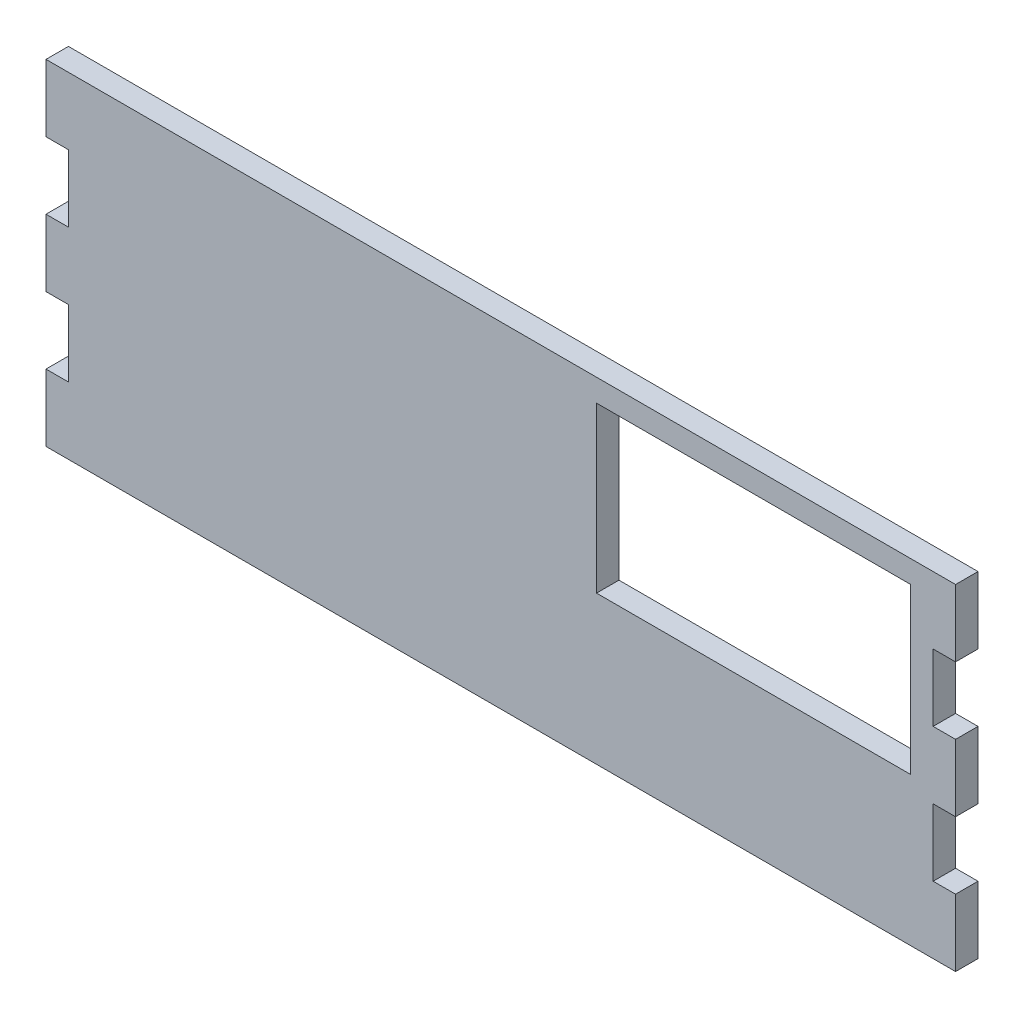
ISO-10303-21;
HEADER;
FILE_DESCRIPTION(('STEP AP214'),'2;1');
FILE_NAME('part.step','',(''),(''),'','','');
FILE_SCHEMA(('AUTOMOTIVE_DESIGN { 1 0 10303 214 1 1 1 1 }'));
ENDSEC;
DATA;
#1=APPLICATION_CONTEXT('core data for automotive mechanical design processes');
#2=APPLICATION_PROTOCOL_DEFINITION('international standard','automotive_design',2000,#1);
#3=PRODUCT_CONTEXT('',#1,'mechanical');
#4=PRODUCT('Part','Part','',(#3));
#5=PRODUCT_RELATED_PRODUCT_CATEGORY('part','',(#4));
#6=PRODUCT_DEFINITION_FORMATION('','',#4);
#7=PRODUCT_DEFINITION_CONTEXT('part definition',#1,'design');
#8=PRODUCT_DEFINITION('design','',#6,#7);
#9=PRODUCT_DEFINITION_SHAPE('','',#8);
#10=(LENGTH_UNIT() NAMED_UNIT(*) SI_UNIT(.MILLI.,.METRE.));
#11=(NAMED_UNIT(*) PLANE_ANGLE_UNIT() SI_UNIT($,.RADIAN.));
#12=(NAMED_UNIT(*) SI_UNIT($,.STERADIAN.) SOLID_ANGLE_UNIT());
#13=UNCERTAINTY_MEASURE_WITH_UNIT(LENGTH_MEASURE(1.E-05),#10,'distance_accuracy_value','');
#14=(GEOMETRIC_REPRESENTATION_CONTEXT(3) GLOBAL_UNCERTAINTY_ASSIGNED_CONTEXT((#13)) GLOBAL_UNIT_ASSIGNED_CONTEXT((#10,
#11,#12)) REPRESENTATION_CONTEXT('',''));
#15=CARTESIAN_POINT('',(0.,0.,0.));
#16=DIRECTION('',(0.,0.,1.));
#17=DIRECTION('',(1.,0.,0.));
#18=AXIS2_PLACEMENT_3D('',#15,#16,#17);
#19=CARTESIAN_POINT('',(0.,0.,3.));
#20=DIRECTION('',(1.,0.,0.));
#21=DIRECTION('',(0.,0.,-1.));
#22=AXIS2_PLACEMENT_3D('',#19,#20,#21);
#23=PLANE('',#22);
#24=DIRECTION('',(0.,-1.,0.));
#25=VECTOR('',#24,1.);
#26=CARTESIAN_POINT('',(0.,0.,3.));
#27=LINE('',#26,#25);
#28=CARTESIAN_POINT('',(0.,26.892,3.));
#29=VERTEX_POINT('',#28);
#30=CARTESIAN_POINT('',(0.,17.928,3.));
#31=VERTEX_POINT('',#30);
#32=EDGE_CURVE('E346',#29,#31,#27,.T.);
#33=ORIENTED_EDGE('',*,*,#32,.F.);
#34=DIRECTION('',(0.,0.,1.));
#35=VECTOR('',#34,1.);
#36=CARTESIAN_POINT('',(0.,26.892,0.));
#37=LINE('',#36,#35);
#38=CARTESIAN_POINT('',(0.,26.892,0.));
#39=VERTEX_POINT('',#38);
#40=EDGE_CURVE('E243',#39,#29,#37,.T.);
#41=ORIENTED_EDGE('',*,*,#40,.F.);
#42=DIRECTION('',(0.,-1.,0.));
#43=VECTOR('',#42,1.);
#44=CARTESIAN_POINT('',(0.,0.,0.));
#45=LINE('',#44,#43);
#46=CARTESIAN_POINT('',(0.,17.928,0.));
#47=VERTEX_POINT('',#46);
#48=EDGE_CURVE('E361',#39,#47,#45,.T.);
#49=ORIENTED_EDGE('',*,*,#48,.T.);
#50=DIRECTION('',(0.,0.,1.));
#51=VECTOR('',#50,1.);
#52=CARTESIAN_POINT('',(0.,17.928,0.));
#53=LINE('',#52,#51);
#54=EDGE_CURVE('E306',#47,#31,#53,.T.);
#55=ORIENTED_EDGE('',*,*,#54,.T.);
#56=EDGE_LOOP('',(#33,#41,#49,#55));
#57=FACE_BOUND('',#56,.T.);
#58=ADVANCED_FACE('F39',(#57),#23,.F.);
#59=CARTESIAN_POINT('',(0.,8.96399999999996,3.));
#60=VERTEX_POINT('',#59);
#61=CARTESIAN_POINT('',(0.,0.,3.));
#62=VERTEX_POINT('',#61);
#63=EDGE_CURVE('E347',#60,#62,#27,.T.);
#64=ORIENTED_EDGE('',*,*,#63,.F.);
#65=DIRECTION('',(0.,0.,1.));
#66=VECTOR('',#65,1.);
#67=CARTESIAN_POINT('',(0.,8.96399999999996,0.));
#68=LINE('',#67,#66);
#69=CARTESIAN_POINT('',(0.,8.96399999999996,0.));
#70=VERTEX_POINT('',#69);
#71=EDGE_CURVE('E304',#70,#60,#68,.T.);
#72=ORIENTED_EDGE('',*,*,#71,.F.);
#73=CARTESIAN_POINT('',(0.,0.,0.));
#74=VERTEX_POINT('',#73);
#75=EDGE_CURVE('E341',#70,#74,#45,.T.);
#76=ORIENTED_EDGE('',*,*,#75,.T.);
#77=DIRECTION('',(0.,0.,-1.));
#78=VECTOR('',#77,1.);
#79=CARTESIAN_POINT('',(0.,0.,3.));
#80=LINE('',#79,#78);
#81=EDGE_CURVE('E11',#62,#74,#80,.T.);
#82=ORIENTED_EDGE('',*,*,#81,.F.);
#83=EDGE_LOOP('',(#64,#72,#76,#82));
#84=FACE_BOUND('',#83,.T.);
#85=ADVANCED_FACE('F399',(#84),#23,.F.);
#86=CARTESIAN_POINT('',(121.6,0.,3.));
#87=DIRECTION('',(-1.,0.,0.));
#88=DIRECTION('',(0.,-1.,0.));
#89=AXIS2_PLACEMENT_3D('',#86,#87,#88);
#90=PLANE('',#89);
#91=DIRECTION('',(0.,1.,0.));
#92=VECTOR('',#91,1.);
#93=CARTESIAN_POINT('',(121.6,0.,3.));
#94=LINE('',#93,#92);
#95=CARTESIAN_POINT('',(121.6,17.9280000000001,3.));
#96=VERTEX_POINT('',#95);
#97=CARTESIAN_POINT('',(121.6,26.8919999999999,3.));
#98=VERTEX_POINT('',#97);
#99=EDGE_CURVE('E354',#96,#98,#94,.T.);
#100=ORIENTED_EDGE('',*,*,#99,.F.);
#101=DIRECTION('',(0.,0.,1.));
#102=VECTOR('',#101,1.);
#103=CARTESIAN_POINT('',(121.6,17.9280000000001,0.));
#104=LINE('',#103,#102);
#105=CARTESIAN_POINT('',(121.6,17.9280000000001,0.));
#106=VERTEX_POINT('',#105);
#107=EDGE_CURVE('E227',#106,#96,#104,.T.);
#108=ORIENTED_EDGE('',*,*,#107,.F.);
#109=DIRECTION('',(0.,1.,0.));
#110=VECTOR('',#109,1.);
#111=CARTESIAN_POINT('',(121.6,0.,0.));
#112=LINE('',#111,#110);
#113=CARTESIAN_POINT('',(121.6,26.8919999999999,0.));
#114=VERTEX_POINT('',#113);
#115=EDGE_CURVE('E368',#106,#114,#112,.T.);
#116=ORIENTED_EDGE('',*,*,#115,.T.);
#117=DIRECTION('',(0.,0.,1.));
#118=VECTOR('',#117,1.);
#119=CARTESIAN_POINT('',(121.6,26.8919999999999,0.));
#120=LINE('',#119,#118);
#121=EDGE_CURVE('E54',#114,#98,#120,.T.);
#122=ORIENTED_EDGE('',*,*,#121,.T.);
#123=EDGE_LOOP('',(#100,#108,#116,#122));
#124=FACE_BOUND('',#123,.T.);
#125=ADVANCED_FACE('F438',(#124),#90,.F.);
#126=CARTESIAN_POINT('',(121.6,35.856,3.));
#127=VERTEX_POINT('',#126);
#128=CARTESIAN_POINT('',(121.6,44.82,3.));
#129=VERTEX_POINT('',#128);
#130=EDGE_CURVE('E349',#127,#129,#94,.T.);
#131=ORIENTED_EDGE('',*,*,#130,.F.);
#132=DIRECTION('',(0.,0.,1.));
#133=VECTOR('',#132,1.);
#134=CARTESIAN_POINT('',(121.6,35.856,0.));
#135=LINE('',#134,#133);
#136=CARTESIAN_POINT('',(121.6,35.856,0.));
#137=VERTEX_POINT('',#136);
#138=EDGE_CURVE('E212',#137,#127,#135,.T.);
#139=ORIENTED_EDGE('',*,*,#138,.F.);
#140=CARTESIAN_POINT('',(121.6,44.82,0.));
#141=VERTEX_POINT('',#140);
#142=EDGE_CURVE('E363',#137,#141,#112,.T.);
#143=ORIENTED_EDGE('',*,*,#142,.T.);
#144=DIRECTION('',(0.,0.,-1.));
#145=VECTOR('',#144,1.);
#146=CARTESIAN_POINT('',(121.6,44.82,3.));
#147=LINE('',#146,#145);
#148=EDGE_CURVE('E372',#129,#141,#147,.T.);
#149=ORIENTED_EDGE('',*,*,#148,.F.);
#150=EDGE_LOOP('',(#131,#139,#143,#149));
#151=FACE_BOUND('',#150,.T.);
#152=ADVANCED_FACE('F458',(#151),#90,.F.);
#153=CARTESIAN_POINT('',(0.,44.82,0.));
#154=VERTEX_POINT('',#153);
#155=CARTESIAN_POINT('',(0.,35.856,0.));
#156=VERTEX_POINT('',#155);
#157=EDGE_CURVE('E357',#154,#156,#45,.T.);
#158=ORIENTED_EDGE('',*,*,#157,.T.);
#159=DIRECTION('',(0.,0.,1.));
#160=VECTOR('',#159,1.);
#161=CARTESIAN_POINT('',(0.,35.856,0.));
#162=LINE('',#161,#160);
#163=CARTESIAN_POINT('',(0.,35.856,3.));
#164=VERTEX_POINT('',#163);
#165=EDGE_CURVE('E240',#156,#164,#162,.T.);
#166=ORIENTED_EDGE('',*,*,#165,.T.);
#167=CARTESIAN_POINT('',(0.,44.82,3.));
#168=VERTEX_POINT('',#167);
#169=EDGE_CURVE('E342',#168,#164,#27,.T.);
#170=ORIENTED_EDGE('',*,*,#169,.F.);
#171=DIRECTION('',(0.,0.,-1.));
#172=VECTOR('',#171,1.);
#173=CARTESIAN_POINT('',(0.,44.82,3.));
#174=LINE('',#173,#172);
#175=EDGE_CURVE('E356',#168,#154,#174,.T.);
#176=ORIENTED_EDGE('',*,*,#175,.T.);
#177=EDGE_LOOP('',(#158,#166,#170,#176));
#178=FACE_BOUND('',#177,.T.);
#179=ADVANCED_FACE('F41',(#178),#23,.F.);
#180=CARTESIAN_POINT('',(0.,0.,3.));
#181=DIRECTION('',(0.,1.,0.));
#182=DIRECTION('',(0.,0.,1.));
#183=AXIS2_PLACEMENT_3D('',#180,#181,#182);
#184=PLANE('',#183);
#185=DIRECTION('',(1.,0.,0.));
#186=VECTOR('',#185,1.);
#187=CARTESIAN_POINT('',(0.,0.,0.));
#188=LINE('',#187,#186);
#189=CARTESIAN_POINT('',(121.6,0.,0.));
#190=VERTEX_POINT('',#189);
#191=EDGE_CURVE('E360',#74,#190,#188,.T.);
#192=ORIENTED_EDGE('',*,*,#191,.T.);
#193=DIRECTION('',(0.,0.,-1.));
#194=VECTOR('',#193,1.);
#195=CARTESIAN_POINT('',(121.6,0.,3.));
#196=LINE('',#195,#194);
#197=CARTESIAN_POINT('',(121.6,0.,3.));
#198=VERTEX_POINT('',#197);
#199=EDGE_CURVE('E47',#198,#190,#196,.T.);
#200=ORIENTED_EDGE('',*,*,#199,.F.);
#201=DIRECTION('',(1.,0.,0.));
#202=VECTOR('',#201,1.);
#203=CARTESIAN_POINT('',(0.,0.,3.));
#204=LINE('',#203,#202);
#205=EDGE_CURVE('E345',#62,#198,#204,.T.);
#206=ORIENTED_EDGE('',*,*,#205,.F.);
#207=ORIENTED_EDGE('',*,*,#81,.T.);
#208=EDGE_LOOP('',(#192,#200,#206,#207));
#209=FACE_BOUND('',#208,.T.);
#210=ADVANCED_FACE('F397',(#209),#184,.F.);
#211=CARTESIAN_POINT('',(121.6,8.96399999999995,0.));
#212=VERTEX_POINT('',#211);
#213=EDGE_CURVE('E364',#190,#212,#112,.T.);
#214=ORIENTED_EDGE('',*,*,#213,.T.);
#215=DIRECTION('',(0.,0.,1.));
#216=VECTOR('',#215,1.);
#217=CARTESIAN_POINT('',(121.6,8.96399999999995,0.));
#218=LINE('',#217,#216);
#219=CARTESIAN_POINT('',(121.6,8.96399999999995,3.));
#220=VERTEX_POINT('',#219);
#221=EDGE_CURVE('E62',#212,#220,#218,.T.);
#222=ORIENTED_EDGE('',*,*,#221,.T.);
#223=EDGE_CURVE('E350',#198,#220,#94,.T.);
#224=ORIENTED_EDGE('',*,*,#223,.F.);
#225=ORIENTED_EDGE('',*,*,#199,.T.);
#226=EDGE_LOOP('',(#214,#222,#224,#225));
#227=FACE_BOUND('',#226,.T.);
#228=ADVANCED_FACE('F379',(#227),#90,.F.);
#229=CARTESIAN_POINT('',(0.,44.82,3.));
#230=DIRECTION('',(0.,-1.,0.));
#231=DIRECTION('',(0.,0.,-1.));
#232=AXIS2_PLACEMENT_3D('',#229,#230,#231);
#233=PLANE('',#232);
#234=DIRECTION('',(-1.,0.,0.));
#235=VECTOR('',#234,1.);
#236=CARTESIAN_POINT('',(0.,44.82,0.));
#237=LINE('',#236,#235);
#238=EDGE_CURVE('E367',#141,#154,#237,.T.);
#239=ORIENTED_EDGE('',*,*,#238,.T.);
#240=ORIENTED_EDGE('',*,*,#175,.F.);
#241=DIRECTION('',(-1.,0.,0.));
#242=VECTOR('',#241,1.);
#243=CARTESIAN_POINT('',(0.,44.82,3.));
#244=LINE('',#243,#242);
#245=EDGE_CURVE('E353',#129,#168,#244,.T.);
#246=ORIENTED_EDGE('',*,*,#245,.F.);
#247=ORIENTED_EDGE('',*,*,#148,.T.);
#248=EDGE_LOOP('',(#239,#240,#246,#247));
#249=FACE_BOUND('',#248,.T.);
#250=ADVANCED_FACE('F429',(#249),#233,.F.);
#251=CARTESIAN_POINT('',(0.,0.,3.));
#252=DIRECTION('',(0.,0.,-1.));
#253=DIRECTION('',(-1.,0.,0.));
#254=AXIS2_PLACEMENT_3D('',#251,#252,#253);
#255=PLANE('',#254);
#256=DIRECTION('',(-1.,0.,0.));
#257=VECTOR('',#256,1.);
#258=CARTESIAN_POINT('',(115.6,41.82,3.));
#259=LINE('',#258,#257);
#260=CARTESIAN_POINT('',(115.6,41.82,3.));
#261=VERTEX_POINT('',#260);
#262=CARTESIAN_POINT('',(73.6,41.82,3.));
#263=VERTEX_POINT('',#262);
#264=EDGE_CURVE('E320',#261,#263,#259,.T.);
#265=ORIENTED_EDGE('',*,*,#264,.F.);
#266=DIRECTION('',(0.,1.,0.));
#267=VECTOR('',#266,1.);
#268=CARTESIAN_POINT('',(115.6,41.82,3.));
#269=LINE('',#268,#267);
#270=CARTESIAN_POINT('',(115.6,19.82,3.));
#271=VERTEX_POINT('',#270);
#272=EDGE_CURVE('E318',#271,#261,#269,.T.);
#273=ORIENTED_EDGE('',*,*,#272,.F.);
#274=DIRECTION('',(1.,0.,0.));
#275=VECTOR('',#274,1.);
#276=CARTESIAN_POINT('',(115.6,19.82,3.));
#277=LINE('',#276,#275);
#278=CARTESIAN_POINT('',(73.6,19.82,3.));
#279=VERTEX_POINT('',#278);
#280=EDGE_CURVE('E326',#279,#271,#277,.T.);
#281=ORIENTED_EDGE('',*,*,#280,.F.);
#282=DIRECTION('',(0.,-1.,0.));
#283=VECTOR('',#282,1.);
#284=CARTESIAN_POINT('',(73.6,41.82,3.));
#285=LINE('',#284,#283);
#286=EDGE_CURVE('E323',#263,#279,#285,.T.);
#287=ORIENTED_EDGE('',*,*,#286,.F.);
#288=EDGE_LOOP('',(#265,#273,#281,#287));
#289=FACE_BOUND('',#288,.T.);
#290=DIRECTION('',(0.,1.,0.));
#291=VECTOR('',#290,1.);
#292=CARTESIAN_POINT('',(3.00000000000009,26.892,3.));
#293=LINE('',#292,#291);
#294=CARTESIAN_POINT('',(3.00000000000009,26.892,3.));
#295=VERTEX_POINT('',#294);
#296=CARTESIAN_POINT('',(3.00000000000009,35.856,3.));
#297=VERTEX_POINT('',#296);
#298=EDGE_CURVE('E254',#295,#297,#293,.T.);
#299=ORIENTED_EDGE('',*,*,#298,.F.);
#300=DIRECTION('',(1.,0.,0.));
#301=VECTOR('',#300,1.);
#302=CARTESIAN_POINT('',(3.00000000000009,26.892,3.));
#303=LINE('',#302,#301);
#304=EDGE_CURVE('E248',#29,#295,#303,.T.);
#305=ORIENTED_EDGE('',*,*,#304,.F.);
#306=ORIENTED_EDGE('',*,*,#32,.T.);
#307=DIRECTION('',(-1.,0.,0.));
#308=VECTOR('',#307,1.);
#309=CARTESIAN_POINT('',(3.00000000000009,17.928,3.));
#310=LINE('',#309,#308);
#311=CARTESIAN_POINT('',(3.00000000000009,17.928,3.));
#312=VERTEX_POINT('',#311);
#313=EDGE_CURVE('E297',#312,#31,#310,.T.);
#314=ORIENTED_EDGE('',*,*,#313,.F.);
#315=DIRECTION('',(0.,1.,0.));
#316=VECTOR('',#315,1.);
#317=CARTESIAN_POINT('',(3.00000000000009,8.96399999999996,3.));
#318=LINE('',#317,#316);
#319=CARTESIAN_POINT('',(3.00000000000009,8.96399999999996,3.));
#320=VERTEX_POINT('',#319);
#321=EDGE_CURVE('E257',#320,#312,#318,.T.);
#322=ORIENTED_EDGE('',*,*,#321,.F.);
#323=DIRECTION('',(1.,0.,0.));
#324=VECTOR('',#323,1.);
#325=CARTESIAN_POINT('',(3.00000000000009,8.96399999999996,3.));
#326=LINE('',#325,#324);
#327=EDGE_CURVE('E288',#60,#320,#326,.T.);
#328=ORIENTED_EDGE('',*,*,#327,.F.);
#329=ORIENTED_EDGE('',*,*,#63,.T.);
#330=ORIENTED_EDGE('',*,*,#205,.T.);
#331=ORIENTED_EDGE('',*,*,#223,.T.);
#332=DIRECTION('',(1.,0.,0.));
#333=VECTOR('',#332,1.);
#334=CARTESIAN_POINT('',(118.6,8.96399999999995,3.));
#335=LINE('',#334,#333);
#336=CARTESIAN_POINT('',(118.6,8.96399999999995,3.));
#337=VERTEX_POINT('',#336);
#338=EDGE_CURVE('E273',#337,#220,#335,.T.);
#339=ORIENTED_EDGE('',*,*,#338,.F.);
#340=DIRECTION('',(0.,-1.,0.));
#341=VECTOR('',#340,1.);
#342=CARTESIAN_POINT('',(118.6,8.96399999999995,3.));
#343=LINE('',#342,#341);
#344=CARTESIAN_POINT('',(118.6,17.9280000000001,3.));
#345=VERTEX_POINT('',#344);
#346=EDGE_CURVE('E247',#345,#337,#343,.T.);
#347=ORIENTED_EDGE('',*,*,#346,.F.);
#348=DIRECTION('',(-1.,0.,0.));
#349=VECTOR('',#348,1.);
#350=CARTESIAN_POINT('',(118.6,17.9280000000001,3.));
#351=LINE('',#350,#349);
#352=EDGE_CURVE('E270',#96,#345,#351,.T.);
#353=ORIENTED_EDGE('',*,*,#352,.F.);
#354=ORIENTED_EDGE('',*,*,#99,.T.);
#355=DIRECTION('',(1.,0.,0.));
#356=VECTOR('',#355,1.);
#357=CARTESIAN_POINT('',(118.6,26.8919999999999,3.));
#358=LINE('',#357,#356);
#359=CARTESIAN_POINT('',(118.6,26.8919999999999,3.));
#360=VERTEX_POINT('',#359);
#361=EDGE_CURVE('E220',#360,#98,#358,.T.);
#362=ORIENTED_EDGE('',*,*,#361,.F.);
#363=DIRECTION('',(0.,-1.,0.));
#364=VECTOR('',#363,1.);
#365=CARTESIAN_POINT('',(118.6,26.8919999999999,3.));
#366=LINE('',#365,#364);
#367=CARTESIAN_POINT('',(118.6,35.856,3.));
#368=VERTEX_POINT('',#367);
#369=EDGE_CURVE('E206',#368,#360,#366,.T.);
#370=ORIENTED_EDGE('',*,*,#369,.F.);
#371=DIRECTION('',(-1.,0.,0.));
#372=VECTOR('',#371,1.);
#373=CARTESIAN_POINT('',(118.6,35.856,3.));
#374=LINE('',#373,#372);
#375=EDGE_CURVE('E215',#127,#368,#374,.T.);
#376=ORIENTED_EDGE('',*,*,#375,.F.);
#377=ORIENTED_EDGE('',*,*,#130,.T.);
#378=ORIENTED_EDGE('',*,*,#245,.T.);
#379=ORIENTED_EDGE('',*,*,#169,.T.);
#380=DIRECTION('',(-1.,0.,0.));
#381=VECTOR('',#380,1.);
#382=CARTESIAN_POINT('',(3.00000000000009,35.856,3.));
#383=LINE('',#382,#381);
#384=EDGE_CURVE('E251',#297,#164,#383,.T.);
#385=ORIENTED_EDGE('',*,*,#384,.F.);
#386=EDGE_LOOP('',(#299,#305,#306,#314,#322,#328,#329,#330,#331,#339,#347,#353,#354,#362,#370,
#376,#377,#378,#379,#385));
#387=FACE_BOUND('',#386,.T.);
#388=ADVANCED_FACE('F223',(#289,#387),#255,.F.);
#389=CARTESIAN_POINT('',(0.,0.,0.));
#390=DIRECTION('',(0.,0.,-1.));
#391=DIRECTION('',(-1.,0.,0.));
#392=AXIS2_PLACEMENT_3D('',#389,#390,#391);
#393=PLANE('',#392);
#394=DIRECTION('',(1.,0.,0.));
#395=VECTOR('',#394,1.);
#396=CARTESIAN_POINT('',(3.00000000000009,26.892,0.));
#397=LINE('',#396,#395);
#398=CARTESIAN_POINT('',(3.00000000000009,26.892,0.));
#399=VERTEX_POINT('',#398);
#400=EDGE_CURVE('E239',#39,#399,#397,.T.);
#401=ORIENTED_EDGE('',*,*,#400,.T.);
#402=DIRECTION('',(0.,1.,0.));
#403=VECTOR('',#402,1.);
#404=CARTESIAN_POINT('',(3.00000000000009,26.892,0.));
#405=LINE('',#404,#403);
#406=CARTESIAN_POINT('',(3.00000000000009,35.856,0.));
#407=VERTEX_POINT('',#406);
#408=EDGE_CURVE('E252',#399,#407,#405,.T.);
#409=ORIENTED_EDGE('',*,*,#408,.T.);
#410=DIRECTION('',(-1.,0.,0.));
#411=VECTOR('',#410,1.);
#412=CARTESIAN_POINT('',(3.00000000000009,35.856,0.));
#413=LINE('',#412,#411);
#414=EDGE_CURVE('E260',#407,#156,#413,.T.);
#415=ORIENTED_EDGE('',*,*,#414,.T.);
#416=ORIENTED_EDGE('',*,*,#157,.F.);
#417=ORIENTED_EDGE('',*,*,#238,.F.);
#418=ORIENTED_EDGE('',*,*,#142,.F.);
#419=DIRECTION('',(-1.,0.,0.));
#420=VECTOR('',#419,1.);
#421=CARTESIAN_POINT('',(118.6,35.856,0.));
#422=LINE('',#421,#420);
#423=CARTESIAN_POINT('',(118.6,35.856,0.));
#424=VERTEX_POINT('',#423);
#425=EDGE_CURVE('E231',#137,#424,#422,.T.);
#426=ORIENTED_EDGE('',*,*,#425,.T.);
#427=DIRECTION('',(0.,-1.,0.));
#428=VECTOR('',#427,1.);
#429=CARTESIAN_POINT('',(118.6,26.8919999999999,0.));
#430=LINE('',#429,#428);
#431=CARTESIAN_POINT('',(118.6,26.8919999999999,0.));
#432=VERTEX_POINT('',#431);
#433=EDGE_CURVE('E209',#424,#432,#430,.T.);
#434=ORIENTED_EDGE('',*,*,#433,.T.);
#435=DIRECTION('',(1.,0.,0.));
#436=VECTOR('',#435,1.);
#437=CARTESIAN_POINT('',(118.6,26.8919999999999,0.));
#438=LINE('',#437,#436);
#439=EDGE_CURVE('E233',#432,#114,#438,.T.);
#440=ORIENTED_EDGE('',*,*,#439,.T.);
#441=ORIENTED_EDGE('',*,*,#115,.F.);
#442=DIRECTION('',(-1.,0.,0.));
#443=VECTOR('',#442,1.);
#444=CARTESIAN_POINT('',(118.6,17.9280000000001,0.));
#445=LINE('',#444,#443);
#446=CARTESIAN_POINT('',(118.6,17.9280000000001,0.));
#447=VERTEX_POINT('',#446);
#448=EDGE_CURVE('E267',#106,#447,#445,.T.);
#449=ORIENTED_EDGE('',*,*,#448,.T.);
#450=DIRECTION('',(0.,-1.,0.));
#451=VECTOR('',#450,1.);
#452=CARTESIAN_POINT('',(118.6,8.96399999999995,0.));
#453=LINE('',#452,#451);
#454=CARTESIAN_POINT('',(118.6,8.96399999999995,0.));
#455=VERTEX_POINT('',#454);
#456=EDGE_CURVE('E274',#447,#455,#453,.T.);
#457=ORIENTED_EDGE('',*,*,#456,.T.);
#458=DIRECTION('',(1.,0.,0.));
#459=VECTOR('',#458,1.);
#460=CARTESIAN_POINT('',(118.6,8.96399999999995,0.));
#461=LINE('',#460,#459);
#462=EDGE_CURVE('E280',#455,#212,#461,.T.);
#463=ORIENTED_EDGE('',*,*,#462,.T.);
#464=ORIENTED_EDGE('',*,*,#213,.F.);
#465=ORIENTED_EDGE('',*,*,#191,.F.);
#466=ORIENTED_EDGE('',*,*,#75,.F.);
#467=DIRECTION('',(1.,0.,0.));
#468=VECTOR('',#467,1.);
#469=CARTESIAN_POINT('',(3.00000000000009,8.96399999999996,0.));
#470=LINE('',#469,#468);
#471=CARTESIAN_POINT('',(3.00000000000009,8.96399999999996,0.));
#472=VERTEX_POINT('',#471);
#473=EDGE_CURVE('E291',#70,#472,#470,.T.);
#474=ORIENTED_EDGE('',*,*,#473,.T.);
#475=DIRECTION('',(0.,1.,0.));
#476=VECTOR('',#475,1.);
#477=CARTESIAN_POINT('',(3.00000000000009,8.96399999999996,0.));
#478=LINE('',#477,#476);
#479=CARTESIAN_POINT('',(3.00000000000009,17.928,0.));
#480=VERTEX_POINT('',#479);
#481=EDGE_CURVE('E284',#472,#480,#478,.T.);
#482=ORIENTED_EDGE('',*,*,#481,.T.);
#483=DIRECTION('',(-1.,0.,0.));
#484=VECTOR('',#483,1.);
#485=CARTESIAN_POINT('',(3.00000000000009,17.928,0.));
#486=LINE('',#485,#484);
#487=EDGE_CURVE('E287',#480,#47,#486,.T.);
#488=ORIENTED_EDGE('',*,*,#487,.T.);
#489=ORIENTED_EDGE('',*,*,#48,.F.);
#490=EDGE_LOOP('',(#401,#409,#415,#416,#417,#418,#426,#434,#440,#441,#449,#457,#463,#464,#465,
#466,#474,#482,#488,#489));
#491=FACE_BOUND('',#490,.T.);
#492=DIRECTION('',(0.,1.,0.));
#493=VECTOR('',#492,1.);
#494=CARTESIAN_POINT('',(115.6,41.82,0.));
#495=LINE('',#494,#493);
#496=CARTESIAN_POINT('',(115.6,19.82,0.));
#497=VERTEX_POINT('',#496);
#498=CARTESIAN_POINT('',(115.6,41.82,0.));
#499=VERTEX_POINT('',#498);
#500=EDGE_CURVE('E315',#497,#499,#495,.T.);
#501=ORIENTED_EDGE('',*,*,#500,.T.);
#502=DIRECTION('',(-1.,0.,0.));
#503=VECTOR('',#502,1.);
#504=CARTESIAN_POINT('',(115.6,41.82,0.));
#505=LINE('',#504,#503);
#506=CARTESIAN_POINT('',(73.6,41.82,0.));
#507=VERTEX_POINT('',#506);
#508=EDGE_CURVE('E332',#499,#507,#505,.T.);
#509=ORIENTED_EDGE('',*,*,#508,.T.);
#510=DIRECTION('',(0.,-1.,0.));
#511=VECTOR('',#510,1.);
#512=CARTESIAN_POINT('',(73.6,41.82,0.));
#513=LINE('',#512,#511);
#514=CARTESIAN_POINT('',(73.6,19.82,0.));
#515=VERTEX_POINT('',#514);
#516=EDGE_CURVE('E303',#507,#515,#513,.T.);
#517=ORIENTED_EDGE('',*,*,#516,.T.);
#518=DIRECTION('',(1.,0.,0.));
#519=VECTOR('',#518,1.);
#520=CARTESIAN_POINT('',(115.6,19.82,0.));
#521=LINE('',#520,#519);
#522=EDGE_CURVE('E312',#515,#497,#521,.T.);
#523=ORIENTED_EDGE('',*,*,#522,.T.);
#524=EDGE_LOOP('',(#501,#509,#517,#523));
#525=FACE_BOUND('',#524,.T.);
#526=ADVANCED_FACE('F384',(#491,#525),#393,.T.);
#527=CARTESIAN_POINT('',(115.6,41.82,-0.00100000000000013));
#528=DIRECTION('',(1.,0.,0.));
#529=DIRECTION('',(0.,1.,0.));
#530=AXIS2_PLACEMENT_3D('',#527,#528,#529);
#531=PLANE('',#530);
#532=DIRECTION('',(0.,0.,1.));
#533=VECTOR('',#532,1.);
#534=CARTESIAN_POINT('',(115.6,19.82,-0.00100000000000013));
#535=LINE('',#534,#533);
#536=EDGE_CURVE('E330',#497,#271,#535,.T.);
#537=ORIENTED_EDGE('',*,*,#536,.T.);
#538=ORIENTED_EDGE('',*,*,#272,.T.);
#539=DIRECTION('',(0.,0.,1.));
#540=VECTOR('',#539,1.);
#541=CARTESIAN_POINT('',(115.6,41.82,-0.00100000000000013));
#542=LINE('',#541,#540);
#543=EDGE_CURVE('E329',#499,#261,#542,.T.);
#544=ORIENTED_EDGE('',*,*,#543,.F.);
#545=ORIENTED_EDGE('',*,*,#500,.F.);
#546=EDGE_LOOP('',(#537,#538,#544,#545));
#547=FACE_BOUND('',#546,.T.);
#548=ADVANCED_FACE('F479',(#547),#531,.F.);
#549=CARTESIAN_POINT('',(115.6,19.82,-0.00100000000000013));
#550=DIRECTION('',(0.,-1.,0.));
#551=DIRECTION('',(1.,0.,0.));
#552=AXIS2_PLACEMENT_3D('',#549,#550,#551);
#553=PLANE('',#552);
#554=DIRECTION('',(0.,0.,1.));
#555=VECTOR('',#554,1.);
#556=CARTESIAN_POINT('',(73.6,19.82,-0.00100000000000013));
#557=LINE('',#556,#555);
#558=EDGE_CURVE('E333',#515,#279,#557,.T.);
#559=ORIENTED_EDGE('',*,*,#558,.T.);
#560=ORIENTED_EDGE('',*,*,#280,.T.);
#561=ORIENTED_EDGE('',*,*,#536,.F.);
#562=ORIENTED_EDGE('',*,*,#522,.F.);
#563=EDGE_LOOP('',(#559,#560,#561,#562));
#564=FACE_BOUND('',#563,.T.);
#565=ADVANCED_FACE('F483',(#564),#553,.F.);
#566=CARTESIAN_POINT('',(73.6,41.82,-0.00100000000000013));
#567=DIRECTION('',(-1.,0.,0.));
#568=DIRECTION('',(0.,0.,1.));
#569=AXIS2_PLACEMENT_3D('',#566,#567,#568);
#570=PLANE('',#569);
#571=DIRECTION('',(0.,0.,1.));
#572=VECTOR('',#571,1.);
#573=CARTESIAN_POINT('',(73.6,41.82,-0.00100000000000013));
#574=LINE('',#573,#572);
#575=EDGE_CURVE('E335',#507,#263,#574,.T.);
#576=ORIENTED_EDGE('',*,*,#575,.T.);
#577=ORIENTED_EDGE('',*,*,#286,.T.);
#578=ORIENTED_EDGE('',*,*,#558,.F.);
#579=ORIENTED_EDGE('',*,*,#516,.F.);
#580=EDGE_LOOP('',(#576,#577,#578,#579));
#581=FACE_BOUND('',#580,.T.);
#582=ADVANCED_FACE('F489',(#581),#570,.F.);
#583=CARTESIAN_POINT('',(115.6,41.82,-0.00100000000000013));
#584=DIRECTION('',(0.,1.,0.));
#585=DIRECTION('',(-1.,0.,0.));
#586=AXIS2_PLACEMENT_3D('',#583,#584,#585);
#587=PLANE('',#586);
#588=ORIENTED_EDGE('',*,*,#543,.T.);
#589=ORIENTED_EDGE('',*,*,#264,.T.);
#590=ORIENTED_EDGE('',*,*,#575,.F.);
#591=ORIENTED_EDGE('',*,*,#508,.F.);
#592=EDGE_LOOP('',(#588,#589,#590,#591));
#593=FACE_BOUND('',#592,.T.);
#594=ADVANCED_FACE('F485',(#593),#587,.F.);
#595=CARTESIAN_POINT('',(3.00000000000009,8.96399999999996,0.));
#596=DIRECTION('',(1.,0.,0.));
#597=DIRECTION('',(0.,0.,-1.));
#598=AXIS2_PLACEMENT_3D('',#595,#596,#597);
#599=PLANE('',#598);
#600=ORIENTED_EDGE('',*,*,#321,.T.);
#601=DIRECTION('',(0.,0.,1.));
#602=VECTOR('',#601,1.);
#603=CARTESIAN_POINT('',(3.00000000000009,17.928,0.));
#604=LINE('',#603,#602);
#605=EDGE_CURVE('E294',#480,#312,#604,.T.);
#606=ORIENTED_EDGE('',*,*,#605,.F.);
#607=ORIENTED_EDGE('',*,*,#481,.F.);
#608=DIRECTION('',(0.,0.,1.));
#609=VECTOR('',#608,1.);
#610=CARTESIAN_POINT('',(3.00000000000009,8.96399999999996,0.));
#611=LINE('',#610,#609);
#612=EDGE_CURVE('E301',#472,#320,#611,.T.);
#613=ORIENTED_EDGE('',*,*,#612,.T.);
#614=EDGE_LOOP('',(#600,#606,#607,#613));
#615=FACE_BOUND('',#614,.T.);
#616=ADVANCED_FACE('F488',(#615),#599,.F.);
#617=CARTESIAN_POINT('',(3.00000000000009,8.96399999999996,0.));
#618=DIRECTION('',(0.,-1.,0.));
#619=DIRECTION('',(0.,0.,-1.));
#620=AXIS2_PLACEMENT_3D('',#617,#618,#619);
#621=PLANE('',#620);
#622=ORIENTED_EDGE('',*,*,#327,.T.);
#623=ORIENTED_EDGE('',*,*,#612,.F.);
#624=ORIENTED_EDGE('',*,*,#473,.F.);
#625=ORIENTED_EDGE('',*,*,#71,.T.);
#626=EDGE_LOOP('',(#622,#623,#624,#625));
#627=FACE_BOUND('',#626,.T.);
#628=ADVANCED_FACE('F499',(#627),#621,.F.);
#629=CARTESIAN_POINT('',(3.00000000000009,17.928,0.));
#630=DIRECTION('',(0.,1.,0.));
#631=DIRECTION('',(0.,0.,1.));
#632=AXIS2_PLACEMENT_3D('',#629,#630,#631);
#633=PLANE('',#632);
#634=ORIENTED_EDGE('',*,*,#313,.T.);
#635=ORIENTED_EDGE('',*,*,#54,.F.);
#636=ORIENTED_EDGE('',*,*,#487,.F.);
#637=ORIENTED_EDGE('',*,*,#605,.T.);
#638=EDGE_LOOP('',(#634,#635,#636,#637));
#639=FACE_BOUND('',#638,.T.);
#640=ADVANCED_FACE('F410',(#639),#633,.F.);
#641=CARTESIAN_POINT('',(118.6,26.8919999999999,0.));
#642=DIRECTION('',(-1.,0.,0.));
#643=DIRECTION('',(0.,0.,1.));
#644=AXIS2_PLACEMENT_3D('',#641,#642,#643);
#645=PLANE('',#644);
#646=ORIENTED_EDGE('',*,*,#369,.T.);
#647=DIRECTION('',(0.,0.,1.));
#648=VECTOR('',#647,1.);
#649=CARTESIAN_POINT('',(118.6,26.8919999999999,0.));
#650=LINE('',#649,#648);
#651=EDGE_CURVE('E234',#432,#360,#650,.T.);
#652=ORIENTED_EDGE('',*,*,#651,.F.);
#653=ORIENTED_EDGE('',*,*,#433,.F.);
#654=DIRECTION('',(0.,0.,1.));
#655=VECTOR('',#654,1.);
#656=CARTESIAN_POINT('',(118.6,35.856,0.));
#657=LINE('',#656,#655);
#658=EDGE_CURVE('E202',#424,#368,#657,.T.);
#659=ORIENTED_EDGE('',*,*,#658,.T.);
#660=EDGE_LOOP('',(#646,#652,#653,#659));
#661=FACE_BOUND('',#660,.T.);
#662=ADVANCED_FACE('F204',(#661),#645,.F.);
#663=CARTESIAN_POINT('',(118.6,35.856,0.));
#664=DIRECTION('',(0.,1.,0.));
#665=DIRECTION('',(0.,0.,1.));
#666=AXIS2_PLACEMENT_3D('',#663,#664,#665);
#667=PLANE('',#666);
#668=ORIENTED_EDGE('',*,*,#375,.T.);
#669=ORIENTED_EDGE('',*,*,#658,.F.);
#670=ORIENTED_EDGE('',*,*,#425,.F.);
#671=ORIENTED_EDGE('',*,*,#138,.T.);
#672=EDGE_LOOP('',(#668,#669,#670,#671));
#673=FACE_BOUND('',#672,.T.);
#674=ADVANCED_FACE('F216',(#673),#667,.F.);
#675=CARTESIAN_POINT('',(118.6,26.8919999999999,0.));
#676=DIRECTION('',(0.,-1.,0.));
#677=DIRECTION('',(0.,0.,-1.));
#678=AXIS2_PLACEMENT_3D('',#675,#676,#677);
#679=PLANE('',#678);
#680=ORIENTED_EDGE('',*,*,#361,.T.);
#681=ORIENTED_EDGE('',*,*,#121,.F.);
#682=ORIENTED_EDGE('',*,*,#439,.F.);
#683=ORIENTED_EDGE('',*,*,#651,.T.);
#684=EDGE_LOOP('',(#680,#681,#682,#683));
#685=FACE_BOUND('',#684,.T.);
#686=ADVANCED_FACE('F439',(#685),#679,.F.);
#687=CARTESIAN_POINT('',(118.6,8.96399999999995,0.));
#688=DIRECTION('',(-1.,0.,0.));
#689=DIRECTION('',(0.,0.,1.));
#690=AXIS2_PLACEMENT_3D('',#687,#688,#689);
#691=PLANE('',#690);
#692=ORIENTED_EDGE('',*,*,#346,.T.);
#693=DIRECTION('',(0.,0.,1.));
#694=VECTOR('',#693,1.);
#695=CARTESIAN_POINT('',(118.6,8.96399999999995,0.));
#696=LINE('',#695,#694);
#697=EDGE_CURVE('E265',#455,#337,#696,.T.);
#698=ORIENTED_EDGE('',*,*,#697,.F.);
#699=ORIENTED_EDGE('',*,*,#456,.F.);
#700=DIRECTION('',(0.,0.,1.));
#701=VECTOR('',#700,1.);
#702=CARTESIAN_POINT('',(118.6,17.9280000000001,0.));
#703=LINE('',#702,#701);
#704=EDGE_CURVE('E225',#447,#345,#703,.T.);
#705=ORIENTED_EDGE('',*,*,#704,.T.);
#706=EDGE_LOOP('',(#692,#698,#699,#705));
#707=FACE_BOUND('',#706,.T.);
#708=ADVANCED_FACE('F392',(#707),#691,.F.);
#709=CARTESIAN_POINT('',(118.6,17.9280000000001,0.));
#710=DIRECTION('',(0.,1.,0.));
#711=DIRECTION('',(0.,0.,1.));
#712=AXIS2_PLACEMENT_3D('',#709,#710,#711);
#713=PLANE('',#712);
#714=ORIENTED_EDGE('',*,*,#352,.T.);
#715=ORIENTED_EDGE('',*,*,#704,.F.);
#716=ORIENTED_EDGE('',*,*,#448,.F.);
#717=ORIENTED_EDGE('',*,*,#107,.T.);
#718=EDGE_LOOP('',(#714,#715,#716,#717));
#719=FACE_BOUND('',#718,.T.);
#720=ADVANCED_FACE('F449',(#719),#713,.F.);
#721=CARTESIAN_POINT('',(118.6,8.96399999999995,0.));
#722=DIRECTION('',(0.,-1.,0.));
#723=DIRECTION('',(0.,0.,-1.));
#724=AXIS2_PLACEMENT_3D('',#721,#722,#723);
#725=PLANE('',#724);
#726=ORIENTED_EDGE('',*,*,#338,.T.);
#727=ORIENTED_EDGE('',*,*,#221,.F.);
#728=ORIENTED_EDGE('',*,*,#462,.F.);
#729=ORIENTED_EDGE('',*,*,#697,.T.);
#730=EDGE_LOOP('',(#726,#727,#728,#729));
#731=FACE_BOUND('',#730,.T.);
#732=ADVANCED_FACE('F388',(#731),#725,.F.);
#733=CARTESIAN_POINT('',(3.00000000000009,26.892,0.));
#734=DIRECTION('',(1.,0.,0.));
#735=DIRECTION('',(0.,0.,-1.));
#736=AXIS2_PLACEMENT_3D('',#733,#734,#735);
#737=PLANE('',#736);
#738=ORIENTED_EDGE('',*,*,#298,.T.);
#739=DIRECTION('',(0.,0.,1.));
#740=VECTOR('',#739,1.);
#741=CARTESIAN_POINT('',(3.00000000000009,35.856,0.));
#742=LINE('',#741,#740);
#743=EDGE_CURVE('E237',#407,#297,#742,.T.);
#744=ORIENTED_EDGE('',*,*,#743,.F.);
#745=ORIENTED_EDGE('',*,*,#408,.F.);
#746=DIRECTION('',(0.,0.,1.));
#747=VECTOR('',#746,1.);
#748=CARTESIAN_POINT('',(3.00000000000009,26.892,0.));
#749=LINE('',#748,#747);
#750=EDGE_CURVE('E245',#399,#295,#749,.T.);
#751=ORIENTED_EDGE('',*,*,#750,.T.);
#752=EDGE_LOOP('',(#738,#744,#745,#751));
#753=FACE_BOUND('',#752,.T.);
#754=ADVANCED_FACE('F419',(#753),#737,.F.);
#755=CARTESIAN_POINT('',(3.00000000000009,26.892,0.));
#756=DIRECTION('',(0.,-1.,0.));
#757=DIRECTION('',(0.,0.,-1.));
#758=AXIS2_PLACEMENT_3D('',#755,#756,#757);
#759=PLANE('',#758);
#760=ORIENTED_EDGE('',*,*,#304,.T.);
#761=ORIENTED_EDGE('',*,*,#750,.F.);
#762=ORIENTED_EDGE('',*,*,#400,.F.);
#763=ORIENTED_EDGE('',*,*,#40,.T.);
#764=EDGE_LOOP('',(#760,#761,#762,#763));
#765=FACE_BOUND('',#764,.T.);
#766=ADVANCED_FACE('F416',(#765),#759,.F.);
#767=CARTESIAN_POINT('',(3.00000000000009,35.856,0.));
#768=DIRECTION('',(0.,1.,0.));
#769=DIRECTION('',(0.,0.,1.));
#770=AXIS2_PLACEMENT_3D('',#767,#768,#769);
#771=PLANE('',#770);
#772=ORIENTED_EDGE('',*,*,#384,.T.);
#773=ORIENTED_EDGE('',*,*,#165,.F.);
#774=ORIENTED_EDGE('',*,*,#414,.F.);
#775=ORIENTED_EDGE('',*,*,#743,.T.);
#776=EDGE_LOOP('',(#772,#773,#774,#775));
#777=FACE_BOUND('',#776,.T.);
#778=ADVANCED_FACE('F513',(#777),#771,.F.);
#779=CLOSED_SHELL('',(#58,#85,#125,#152,#179,#210,#228,#250,#388,#526,#548,#565,#582,#594,#616,
#628,#640,#662,#674,#686,#708,#720,#732,#754,#766,#778));
#780=MANIFOLD_SOLID_BREP('B2',#779);
#781=ADVANCED_BREP_SHAPE_REPRESENTATION('',(#18,#780),#14);
#782=SHAPE_DEFINITION_REPRESENTATION(#9,#781);
ENDSEC;
END-ISO-10303-21;
